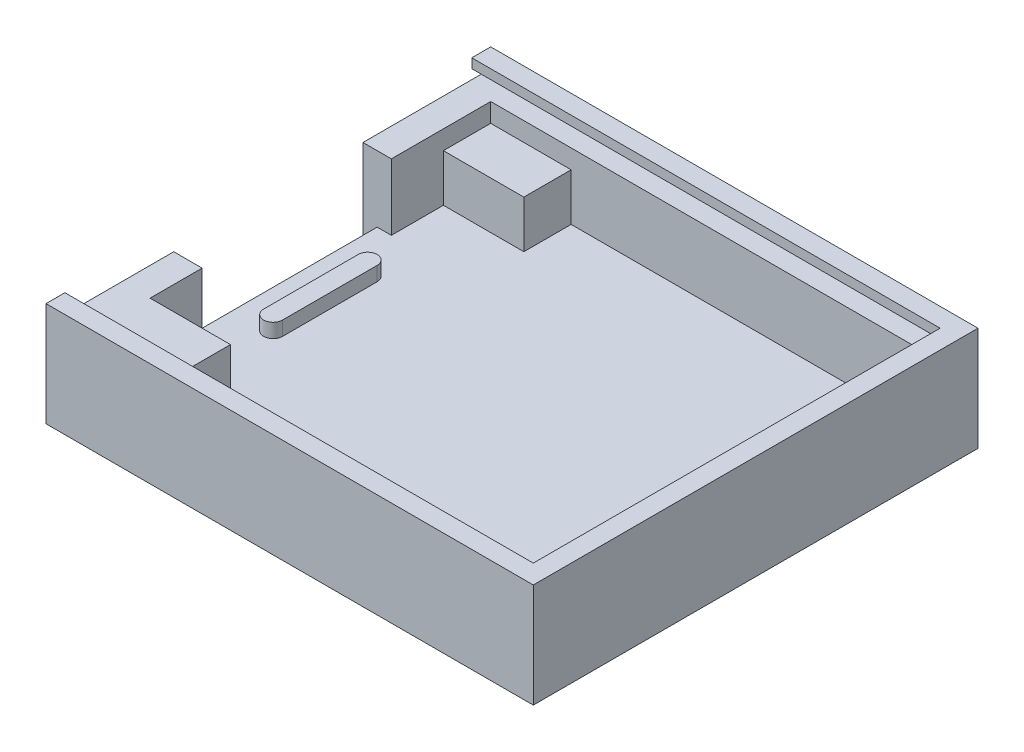
ISO-10303-21;
HEADER;
FILE_DESCRIPTION(('STEP AP214'),'2;1');
FILE_NAME('part.step','',(''),(''),'','','');
FILE_SCHEMA(('AUTOMOTIVE_DESIGN { 1 0 10303 214 1 1 1 1 }'));
ENDSEC;
DATA;
#1=APPLICATION_CONTEXT('core data for automotive mechanical design processes');
#2=APPLICATION_PROTOCOL_DEFINITION('international standard','automotive_design',2000,#1);
#3=PRODUCT_CONTEXT('',#1,'mechanical');
#4=PRODUCT('Part','Part','',(#3));
#5=PRODUCT_RELATED_PRODUCT_CATEGORY('part','',(#4));
#6=PRODUCT_DEFINITION_FORMATION('','',#4);
#7=PRODUCT_DEFINITION_CONTEXT('part definition',#1,'design');
#8=PRODUCT_DEFINITION('design','',#6,#7);
#9=PRODUCT_DEFINITION_SHAPE('','',#8);
#10=(LENGTH_UNIT() NAMED_UNIT(*) SI_UNIT(.MILLI.,.METRE.));
#11=(NAMED_UNIT(*) PLANE_ANGLE_UNIT() SI_UNIT($,.RADIAN.));
#12=(NAMED_UNIT(*) SI_UNIT($,.STERADIAN.) SOLID_ANGLE_UNIT());
#13=UNCERTAINTY_MEASURE_WITH_UNIT(LENGTH_MEASURE(1.E-05),#10,'distance_accuracy_value','');
#14=(GEOMETRIC_REPRESENTATION_CONTEXT(3) GLOBAL_UNCERTAINTY_ASSIGNED_CONTEXT((#13)) GLOBAL_UNIT_ASSIGNED_CONTEXT((#10,
#11,#12)) REPRESENTATION_CONTEXT('',''));
#15=CARTESIAN_POINT('',(0.,0.,0.));
#16=DIRECTION('',(0.,0.,1.));
#17=DIRECTION('',(1.,0.,0.));
#18=AXIS2_PLACEMENT_3D('',#15,#16,#17);
#19=CARTESIAN_POINT('',(-51.5,2.,-47.));
#20=DIRECTION('',(1.,0.,0.));
#21=DIRECTION('',(0.,0.,-1.));
#22=AXIS2_PLACEMENT_3D('',#19,#20,#21);
#23=PLANE('',#22);
#24=DIRECTION('',(0.,0.,1.));
#25=VECTOR('',#24,1.);
#26=CARTESIAN_POINT('',(-51.5,0.,-47.));
#27=LINE('',#26,#25);
#28=CARTESIAN_POINT('',(-51.5,0.,-47.));
#29=VERTEX_POINT('',#28);
#30=CARTESIAN_POINT('',(-51.5,0.,-33.5));
#31=VERTEX_POINT('',#30);
#32=EDGE_CURVE('E264',#29,#31,#27,.T.);
#33=ORIENTED_EDGE('',*,*,#32,.T.);
#34=DIRECTION('',(0.,1.,0.));
#35=VECTOR('',#34,1.);
#36=CARTESIAN_POINT('',(-51.5,2.,-33.5));
#37=LINE('',#36,#35);
#38=CARTESIAN_POINT('',(-51.5,9.,-33.5));
#39=VERTEX_POINT('',#38);
#40=EDGE_CURVE('E430',#31,#39,#37,.T.);
#41=ORIENTED_EDGE('',*,*,#40,.T.);
#42=DIRECTION('',(0.,0.,1.));
#43=VECTOR('',#42,1.);
#44=CARTESIAN_POINT('',(-51.5,9.,-47.));
#45=LINE('',#44,#43);
#46=CARTESIAN_POINT('',(-51.5,9.,-46.));
#47=VERTEX_POINT('',#46);
#48=EDGE_CURVE('E280',#47,#39,#45,.T.);
#49=ORIENTED_EDGE('',*,*,#48,.F.);
#50=DIRECTION('',(0.,-1.,0.));
#51=VECTOR('',#50,1.);
#52=CARTESIAN_POINT('',(-51.5,11.,-46.));
#53=LINE('',#52,#51);
#54=CARTESIAN_POINT('',(-51.5,10.,-46.));
#55=VERTEX_POINT('',#54);
#56=EDGE_CURVE('E360',#55,#47,#53,.T.);
#57=ORIENTED_EDGE('',*,*,#56,.F.);
#58=DIRECTION('',(0.,0.,-1.));
#59=VECTOR('',#58,1.);
#60=CARTESIAN_POINT('',(-51.5,10.,-45.));
#61=LINE('',#60,#59);
#62=CARTESIAN_POINT('',(-51.5,10.,-45.));
#63=VERTEX_POINT('',#62);
#64=EDGE_CURVE('E483',#63,#55,#61,.T.);
#65=ORIENTED_EDGE('',*,*,#64,.F.);
#66=DIRECTION('',(0.,-1.,0.));
#67=VECTOR('',#66,1.);
#68=CARTESIAN_POINT('',(-51.5,11.,-45.));
#69=LINE('',#68,#67);
#70=CARTESIAN_POINT('',(-51.5,11.,-45.));
#71=VERTEX_POINT('',#70);
#72=EDGE_CURVE('E524',#71,#63,#69,.T.);
#73=ORIENTED_EDGE('',*,*,#72,.F.);
#74=DIRECTION('',(0.,0.,1.));
#75=VECTOR('',#74,1.);
#76=CARTESIAN_POINT('',(-51.5,11.,-46.));
#77=LINE('',#76,#75);
#78=CARTESIAN_POINT('',(-51.5,11.,-47.));
#79=VERTEX_POINT('',#78);
#80=EDGE_CURVE('E336',#79,#71,#77,.T.);
#81=ORIENTED_EDGE('',*,*,#80,.F.);
#82=DIRECTION('',(0.,-1.,0.));
#83=VECTOR('',#82,1.);
#84=CARTESIAN_POINT('',(-51.5,2.,-47.));
#85=LINE('',#84,#83);
#86=EDGE_CURVE('E43',#79,#29,#85,.T.);
#87=ORIENTED_EDGE('',*,*,#86,.T.);
#88=EDGE_LOOP('',(#33,#41,#49,#57,#65,#73,#81,#87));
#89=FACE_BOUND('',#88,.T.);
#90=ADVANCED_FACE('F33',(#89),#23,.F.);
#91=CARTESIAN_POINT('',(-0.999999999999994,11.,-0.999999999999994));
#92=DIRECTION('',(1.,0.,0.));
#93=DIRECTION('',(0.,0.,-1.));
#94=AXIS2_PLACEMENT_3D('',#91,#92,#93);
#95=PLANE('',#94);
#96=DIRECTION('',(0.,-1.,0.));
#97=VECTOR('',#96,1.);
#98=CARTESIAN_POINT('',(-0.999999999999994,11.,-0.999999999999994));
#99=LINE('',#98,#97);
#100=CARTESIAN_POINT('',(-0.999999999999994,10.,-0.999999999999994));
#101=VERTEX_POINT('',#100);
#102=CARTESIAN_POINT('',(-0.999999999999994,9.,-0.999999999999994));
#103=VERTEX_POINT('',#102);
#104=EDGE_CURVE('E351',#101,#103,#99,.T.);
#105=ORIENTED_EDGE('',*,*,#104,.F.);
#106=DIRECTION('',(0.,0.,-1.));
#107=VECTOR('',#106,1.);
#108=CARTESIAN_POINT('',(-0.999999999999994,10.,-45.));
#109=LINE('',#108,#107);
#110=CARTESIAN_POINT('',(-0.999999999999994,10.,-46.));
#111=VERTEX_POINT('',#110);
#112=EDGE_CURVE('E480',#101,#111,#109,.T.);
#113=ORIENTED_EDGE('',*,*,#112,.T.);
#114=DIRECTION('',(0.,-1.,0.));
#115=VECTOR('',#114,1.);
#116=CARTESIAN_POINT('',(-0.999999999999994,11.,-46.));
#117=LINE('',#116,#115);
#118=CARTESIAN_POINT('',(-0.999999999999994,9.,-46.));
#119=VERTEX_POINT('',#118);
#120=EDGE_CURVE('E362',#111,#119,#117,.T.);
#121=ORIENTED_EDGE('',*,*,#120,.T.);
#122=DIRECTION('',(0.,0.,1.));
#123=VECTOR('',#122,1.);
#124=CARTESIAN_POINT('',(-0.999999999999994,9.,-0.999999999999994));
#125=LINE('',#124,#123);
#126=EDGE_CURVE('E344',#119,#103,#125,.T.);
#127=ORIENTED_EDGE('',*,*,#126,.T.);
#128=EDGE_LOOP('',(#105,#113,#121,#127));
#129=FACE_BOUND('',#128,.T.);
#130=ADVANCED_FACE('F479',(#129),#95,.F.);
#131=CARTESIAN_POINT('',(0.,0.,-45.));
#132=DIRECTION('',(0.,0.,1.));
#133=DIRECTION('',(1.,0.,0.));
#134=AXIS2_PLACEMENT_3D('',#131,#132,#133);
#135=PLANE('',#134);
#136=DIRECTION('',(1.,0.,0.));
#137=VECTOR('',#136,1.);
#138=CARTESIAN_POINT('',(-51.5,10.,-45.));
#139=LINE('',#138,#137);
#140=CARTESIAN_POINT('',(-1.99999999999999,10.,-45.));
#141=VERTEX_POINT('',#140);
#142=EDGE_CURVE('E56',#63,#141,#139,.T.);
#143=ORIENTED_EDGE('',*,*,#142,.T.);
#144=DIRECTION('',(0.,-1.,0.));
#145=VECTOR('',#144,1.);
#146=CARTESIAN_POINT('',(-1.99999999999999,11.,-45.));
#147=LINE('',#146,#145);
#148=CARTESIAN_POINT('',(-1.99999999999999,11.,-45.));
#149=VERTEX_POINT('',#148);
#150=EDGE_CURVE('E51',#149,#141,#147,.T.);
#151=ORIENTED_EDGE('',*,*,#150,.F.);
#152=DIRECTION('',(-1.,0.,0.));
#153=VECTOR('',#152,1.);
#154=CARTESIAN_POINT('',(-51.5,11.,-45.));
#155=LINE('',#154,#153);
#156=EDGE_CURVE('E488',#149,#71,#155,.T.);
#157=ORIENTED_EDGE('',*,*,#156,.T.);
#158=ORIENTED_EDGE('',*,*,#72,.T.);
#159=EDGE_LOOP('',(#143,#151,#157,#158));
#160=FACE_BOUND('',#159,.T.);
#161=ADVANCED_FACE('F582',(#160),#135,.T.);
#162=CARTESIAN_POINT('',(0.,0.,-1.99999999999999));
#163=DIRECTION('',(0.,0.,1.));
#164=DIRECTION('',(1.,0.,0.));
#165=AXIS2_PLACEMENT_3D('',#162,#163,#164);
#166=PLANE('',#165);
#167=DIRECTION('',(0.,1.,0.));
#168=VECTOR('',#167,1.);
#169=CARTESIAN_POINT('',(-1.99999999999999,11.,-1.99999999999999));
#170=LINE('',#169,#168);
#171=CARTESIAN_POINT('',(-1.99999999999999,10.,-1.99999999999999));
#172=VERTEX_POINT('',#171);
#173=CARTESIAN_POINT('',(-1.99999999999999,11.,-1.99999999999999));
#174=VERTEX_POINT('',#173);
#175=EDGE_CURVE('E575',#172,#174,#170,.T.);
#176=ORIENTED_EDGE('',*,*,#175,.F.);
#177=DIRECTION('',(-1.,0.,0.));
#178=VECTOR('',#177,1.);
#179=CARTESIAN_POINT('',(-51.5,10.,-1.99999999999999));
#180=LINE('',#179,#178);
#181=CARTESIAN_POINT('',(-51.5,10.,-1.99999999999999));
#182=VERTEX_POINT('',#181);
#183=EDGE_CURVE('E509',#172,#182,#180,.T.);
#184=ORIENTED_EDGE('',*,*,#183,.T.);
#185=DIRECTION('',(0.,1.,0.));
#186=VECTOR('',#185,1.);
#187=CARTESIAN_POINT('',(-51.5,11.,-1.99999999999999));
#188=LINE('',#187,#186);
#189=CARTESIAN_POINT('',(-51.5,11.,-1.99999999999999));
#190=VERTEX_POINT('',#189);
#191=EDGE_CURVE('E502',#182,#190,#188,.T.);
#192=ORIENTED_EDGE('',*,*,#191,.T.);
#193=DIRECTION('',(1.,0.,0.));
#194=VECTOR('',#193,1.);
#195=CARTESIAN_POINT('',(-51.5,11.,-1.99999999999999));
#196=LINE('',#195,#194);
#197=EDGE_CURVE('E504',#190,#174,#196,.T.);
#198=ORIENTED_EDGE('',*,*,#197,.T.);
#199=EDGE_LOOP('',(#176,#184,#192,#198));
#200=FACE_BOUND('',#199,.T.);
#201=ADVANCED_FACE('F511',(#200),#166,.F.);
#202=CARTESIAN_POINT('',(-51.5,11.,-0.999999999999994));
#203=DIRECTION('',(0.,0.,1.));
#204=DIRECTION('',(1.,0.,0.));
#205=AXIS2_PLACEMENT_3D('',#202,#203,#204);
#206=PLANE('',#205);
#207=DIRECTION('',(-1.,0.,0.));
#208=VECTOR('',#207,1.);
#209=CARTESIAN_POINT('',(-51.5,10.,-0.999999999999994));
#210=LINE('',#209,#208);
#211=CARTESIAN_POINT('',(-51.5,10.,-0.999999999999994));
#212=VERTEX_POINT('',#211);
#213=EDGE_CURVE('E478',#101,#212,#210,.T.);
#214=ORIENTED_EDGE('',*,*,#213,.F.);
#215=ORIENTED_EDGE('',*,*,#104,.T.);
#216=DIRECTION('',(-1.,0.,0.));
#217=VECTOR('',#216,1.);
#218=CARTESIAN_POINT('',(-51.5,9.,-0.999999999999994));
#219=LINE('',#218,#217);
#220=CARTESIAN_POINT('',(-51.5,9.,-0.999999999999994));
#221=VERTEX_POINT('',#220);
#222=EDGE_CURVE('E347',#103,#221,#219,.T.);
#223=ORIENTED_EDGE('',*,*,#222,.T.);
#224=DIRECTION('',(0.,-1.,0.));
#225=VECTOR('',#224,1.);
#226=CARTESIAN_POINT('',(-51.5,11.,-0.999999999999994));
#227=LINE('',#226,#225);
#228=EDGE_CURVE('E37',#212,#221,#227,.T.);
#229=ORIENTED_EDGE('',*,*,#228,.F.);
#230=EDGE_LOOP('',(#214,#215,#223,#229));
#231=FACE_BOUND('',#230,.T.);
#232=ADVANCED_FACE('F476',(#231),#206,.F.);
#233=CARTESIAN_POINT('',(-0.999999999999994,11.,-46.));
#234=DIRECTION('',(0.,0.,-1.));
#235=DIRECTION('',(-1.,0.,0.));
#236=AXIS2_PLACEMENT_3D('',#233,#234,#235);
#237=PLANE('',#236);
#238=DIRECTION('',(1.,0.,0.));
#239=VECTOR('',#238,1.);
#240=CARTESIAN_POINT('',(-51.5,10.,-46.));
#241=LINE('',#240,#239);
#242=EDGE_CURVE('E523',#55,#111,#241,.T.);
#243=ORIENTED_EDGE('',*,*,#242,.F.);
#244=ORIENTED_EDGE('',*,*,#56,.T.);
#245=DIRECTION('',(1.,0.,0.));
#246=VECTOR('',#245,1.);
#247=CARTESIAN_POINT('',(-0.999999999999994,9.,-46.));
#248=LINE('',#247,#246);
#249=EDGE_CURVE('E348',#47,#119,#248,.T.);
#250=ORIENTED_EDGE('',*,*,#249,.T.);
#251=ORIENTED_EDGE('',*,*,#120,.F.);
#252=EDGE_LOOP('',(#243,#244,#250,#251));
#253=FACE_BOUND('',#252,.T.);
#254=ADVANCED_FACE('F482',(#253),#237,.F.);
#255=CARTESIAN_POINT('',(0.,2.,0.));
#256=DIRECTION('',(0.,1.,0.));
#257=DIRECTION('',(0.,0.,1.));
#258=AXIS2_PLACEMENT_3D('',#255,#256,#257);
#259=PLANE('',#258);
#260=DIRECTION('',(0.,0.,-1.));
#261=VECTOR('',#260,1.);
#262=CARTESIAN_POINT('',(-50.,2.,-13.5));
#263=LINE('',#262,#261);
#264=CARTESIAN_POINT('',(-50.,2.,-13.5));
#265=VERTEX_POINT('',#264);
#266=CARTESIAN_POINT('',(-50.,2.,-33.5));
#267=VERTEX_POINT('',#266);
#268=EDGE_CURVE('E258',#265,#267,#263,.T.);
#269=ORIENTED_EDGE('',*,*,#268,.F.);
#270=DIRECTION('',(1.,0.,0.));
#271=VECTOR('',#270,1.);
#272=CARTESIAN_POINT('',(0.,2.,-13.5));
#273=LINE('',#272,#271);
#274=CARTESIAN_POINT('',(-48.5,2.,-13.5));
#275=VERTEX_POINT('',#274);
#276=EDGE_CURVE('E423',#265,#275,#273,.T.);
#277=ORIENTED_EDGE('',*,*,#276,.T.);
#278=DIRECTION('',(0.,0.,1.));
#279=VECTOR('',#278,1.);
#280=CARTESIAN_POINT('',(-48.5,2.,-44.));
#281=LINE('',#280,#279);
#282=CARTESIAN_POINT('',(-48.5,2.,-8.));
#283=VERTEX_POINT('',#282);
#284=EDGE_CURVE('E452',#275,#283,#281,.T.);
#285=ORIENTED_EDGE('',*,*,#284,.T.);
#286=DIRECTION('',(-1.,0.,0.));
#287=VECTOR('',#286,1.);
#288=CARTESIAN_POINT('',(-48.5,2.,-8.));
#289=LINE('',#288,#287);
#290=CARTESIAN_POINT('',(-40.,2.,-8.));
#291=VERTEX_POINT('',#290);
#292=EDGE_CURVE('E407',#291,#283,#289,.T.);
#293=ORIENTED_EDGE('',*,*,#292,.F.);
#294=DIRECTION('',(0.,0.,-1.));
#295=VECTOR('',#294,1.);
#296=CARTESIAN_POINT('',(-40.,2.,-3.));
#297=LINE('',#296,#295);
#298=CARTESIAN_POINT('',(-40.,2.,-3.));
#299=VERTEX_POINT('',#298);
#300=EDGE_CURVE('E401',#299,#291,#297,.T.);
#301=ORIENTED_EDGE('',*,*,#300,.F.);
#302=DIRECTION('',(1.,0.,0.));
#303=VECTOR('',#302,1.);
#304=CARTESIAN_POINT('',(-48.5,2.,-3.));
#305=LINE('',#304,#303);
#306=CARTESIAN_POINT('',(-3.,2.,-3.));
#307=VERTEX_POINT('',#306);
#308=EDGE_CURVE('E456',#299,#307,#305,.T.);
#309=ORIENTED_EDGE('',*,*,#308,.T.);
#310=DIRECTION('',(0.,0.,-1.));
#311=VECTOR('',#310,1.);
#312=CARTESIAN_POINT('',(-3.,2.,-3.));
#313=LINE('',#312,#311);
#314=CARTESIAN_POINT('',(-3.,2.,-44.));
#315=VERTEX_POINT('',#314);
#316=EDGE_CURVE('E441',#307,#315,#313,.T.);
#317=ORIENTED_EDGE('',*,*,#316,.T.);
#318=DIRECTION('',(-1.,0.,0.));
#319=VECTOR('',#318,1.);
#320=CARTESIAN_POINT('',(-3.,2.,-44.));
#321=LINE('',#320,#319);
#322=CARTESIAN_POINT('',(-40.,2.,-44.));
#323=VERTEX_POINT('',#322);
#324=EDGE_CURVE('E433',#315,#323,#321,.T.);
#325=ORIENTED_EDGE('',*,*,#324,.T.);
#326=DIRECTION('',(0.,0.,-1.));
#327=VECTOR('',#326,1.);
#328=CARTESIAN_POINT('',(-40.,2.,-44.));
#329=LINE('',#328,#327);
#330=CARTESIAN_POINT('',(-40.,2.,-39.));
#331=VERTEX_POINT('',#330);
#332=EDGE_CURVE('E369',#331,#323,#329,.T.);
#333=ORIENTED_EDGE('',*,*,#332,.F.);
#334=DIRECTION('',(1.,0.,0.));
#335=VECTOR('',#334,1.);
#336=CARTESIAN_POINT('',(-48.5,2.,-39.));
#337=LINE('',#336,#335);
#338=CARTESIAN_POINT('',(-48.5,2.,-39.));
#339=VERTEX_POINT('',#338);
#340=EDGE_CURVE('E361',#339,#331,#337,.T.);
#341=ORIENTED_EDGE('',*,*,#340,.F.);
#342=CARTESIAN_POINT('',(-48.5,2.,-33.5));
#343=VERTEX_POINT('',#342);
#344=EDGE_CURVE('E453',#339,#343,#281,.T.);
#345=ORIENTED_EDGE('',*,*,#344,.T.);
#346=DIRECTION('',(1.,0.,0.));
#347=VECTOR('',#346,1.);
#348=CARTESIAN_POINT('',(0.,2.,-33.5));
#349=LINE('',#348,#347);
#350=EDGE_CURVE('E247',#267,#343,#349,.T.);
#351=ORIENTED_EDGE('',*,*,#350,.F.);
#352=EDGE_LOOP('',(#269,#277,#285,#293,#301,#309,#317,#325,#333,#341,#345,#351));
#353=FACE_BOUND('',#352,.T.);
#354=DIRECTION('',(0.,0.,1.));
#355=VECTOR('',#354,1.);
#356=CARTESIAN_POINT('',(-47.,2.,-28.5));
#357=LINE('',#356,#355);
#358=CARTESIAN_POINT('',(-47.,2.,-28.5));
#359=VERTEX_POINT('',#358);
#360=CARTESIAN_POINT('',(-47.,2.,-18.5));
#361=VERTEX_POINT('',#360);
#362=EDGE_CURVE('E305',#359,#361,#357,.T.);
#363=ORIENTED_EDGE('',*,*,#362,.F.);
#364=CARTESIAN_POINT('',(-46.,2.,-28.5));
#365=DIRECTION('',(0.,1.,0.));
#366=DIRECTION('',(0.,0.,1.));
#367=AXIS2_PLACEMENT_3D('',#364,#365,#366);
#368=CIRCLE('',#367,1.);
#369=CARTESIAN_POINT('',(-45.,2.,-28.5));
#370=VERTEX_POINT('',#369);
#371=EDGE_CURVE('E283',#370,#359,#368,.T.);
#372=ORIENTED_EDGE('',*,*,#371,.F.);
#373=DIRECTION('',(0.,0.,1.));
#374=VECTOR('',#373,1.);
#375=CARTESIAN_POINT('',(-45.,2.,-28.5));
#376=LINE('',#375,#374);
#377=CARTESIAN_POINT('',(-45.,2.,-18.5));
#378=VERTEX_POINT('',#377);
#379=EDGE_CURVE('E295',#370,#378,#376,.T.);
#380=ORIENTED_EDGE('',*,*,#379,.T.);
#381=CARTESIAN_POINT('',(-46.,2.,-18.5));
#382=DIRECTION('',(0.,1.,0.));
#383=DIRECTION('',(0.,0.,1.));
#384=AXIS2_PLACEMENT_3D('',#381,#382,#383);
#385=CIRCLE('',#384,0.999999999999997);
#386=EDGE_CURVE('E308',#361,#378,#385,.T.);
#387=ORIENTED_EDGE('',*,*,#386,.F.);
#388=EDGE_LOOP('',(#363,#372,#380,#387));
#389=FACE_BOUND('',#388,.T.);
#390=ADVANCED_FACE('F549',(#353,#389),#259,.T.);
#391=CARTESIAN_POINT('',(-48.5,9.,-44.));
#392=DIRECTION('',(1.,0.,0.));
#393=DIRECTION('',(0.,0.,-1.));
#394=AXIS2_PLACEMENT_3D('',#391,#392,#393);
#395=PLANE('',#394);
#396=ORIENTED_EDGE('',*,*,#344,.F.);
#397=DIRECTION('',(0.,-1.,0.));
#398=VECTOR('',#397,1.);
#399=CARTESIAN_POINT('',(-48.5,7.,-39.));
#400=LINE('',#399,#398);
#401=CARTESIAN_POINT('',(-48.5,7.,-39.));
#402=VERTEX_POINT('',#401);
#403=EDGE_CURVE('E394',#402,#339,#400,.T.);
#404=ORIENTED_EDGE('',*,*,#403,.F.);
#405=DIRECTION('',(0.,0.,1.));
#406=VECTOR('',#405,1.);
#407=CARTESIAN_POINT('',(-48.5,7.,-44.));
#408=LINE('',#407,#406);
#409=CARTESIAN_POINT('',(-48.5,7.,-44.));
#410=VERTEX_POINT('',#409);
#411=EDGE_CURVE('E376',#410,#402,#408,.T.);
#412=ORIENTED_EDGE('',*,*,#411,.F.);
#413=DIRECTION('',(0.,-1.,0.));
#414=VECTOR('',#413,1.);
#415=CARTESIAN_POINT('',(-48.5,9.,-44.));
#416=LINE('',#415,#414);
#417=CARTESIAN_POINT('',(-48.5,9.,-44.));
#418=VERTEX_POINT('',#417);
#419=EDGE_CURVE('E288',#418,#410,#416,.T.);
#420=ORIENTED_EDGE('',*,*,#419,.F.);
#421=DIRECTION('',(0.,0.,1.));
#422=VECTOR('',#421,1.);
#423=CARTESIAN_POINT('',(-48.5,9.,-44.));
#424=LINE('',#423,#422);
#425=CARTESIAN_POINT('',(-48.5,9.,-33.5));
#426=VERTEX_POINT('',#425);
#427=EDGE_CURVE('E442',#418,#426,#424,.T.);
#428=ORIENTED_EDGE('',*,*,#427,.T.);
#429=DIRECTION('',(0.,1.,0.));
#430=VECTOR('',#429,1.);
#431=CARTESIAN_POINT('',(-48.5,2.,-33.5));
#432=LINE('',#431,#430);
#433=EDGE_CURVE('E434',#343,#426,#432,.T.);
#434=ORIENTED_EDGE('',*,*,#433,.F.);
#435=EDGE_LOOP('',(#396,#404,#412,#420,#428,#434));
#436=FACE_BOUND('',#435,.T.);
#437=ADVANCED_FACE('F539',(#436),#395,.T.);
#438=CARTESIAN_POINT('',(-3.,9.,-44.));
#439=DIRECTION('',(0.,0.,1.));
#440=DIRECTION('',(1.,0.,0.));
#441=AXIS2_PLACEMENT_3D('',#438,#439,#440);
#442=PLANE('',#441);
#443=DIRECTION('',(-1.,0.,0.));
#444=VECTOR('',#443,1.);
#445=CARTESIAN_POINT('',(-48.5,7.,-44.));
#446=LINE('',#445,#444);
#447=CARTESIAN_POINT('',(-40.,7.,-44.));
#448=VERTEX_POINT('',#447);
#449=EDGE_CURVE('E384',#448,#410,#446,.T.);
#450=ORIENTED_EDGE('',*,*,#449,.F.);
#451=DIRECTION('',(0.,-1.,0.));
#452=VECTOR('',#451,1.);
#453=CARTESIAN_POINT('',(-40.,7.,-44.));
#454=LINE('',#453,#452);
#455=EDGE_CURVE('E386',#448,#323,#454,.T.);
#456=ORIENTED_EDGE('',*,*,#455,.T.);
#457=ORIENTED_EDGE('',*,*,#324,.F.);
#458=DIRECTION('',(0.,-1.,0.));
#459=VECTOR('',#458,1.);
#460=CARTESIAN_POINT('',(-3.,9.,-44.));
#461=LINE('',#460,#459);
#462=CARTESIAN_POINT('',(-3.,9.,-44.));
#463=VERTEX_POINT('',#462);
#464=EDGE_CURVE('E449',#463,#315,#461,.T.);
#465=ORIENTED_EDGE('',*,*,#464,.F.);
#466=DIRECTION('',(-1.,0.,0.));
#467=VECTOR('',#466,1.);
#468=CARTESIAN_POINT('',(-3.,9.,-44.));
#469=LINE('',#468,#467);
#470=EDGE_CURVE('E438',#463,#418,#469,.T.);
#471=ORIENTED_EDGE('',*,*,#470,.T.);
#472=ORIENTED_EDGE('',*,*,#419,.T.);
#473=EDGE_LOOP('',(#450,#456,#457,#465,#471,#472));
#474=FACE_BOUND('',#473,.T.);
#475=ADVANCED_FACE('F543',(#474),#442,.T.);
#476=CARTESIAN_POINT('',(-48.5,9.,-13.5));
#477=VERTEX_POINT('',#476);
#478=CARTESIAN_POINT('',(-48.5,9.,-8.));
#479=VERTEX_POINT('',#478);
#480=EDGE_CURVE('E440',#477,#479,#424,.T.);
#481=ORIENTED_EDGE('',*,*,#480,.T.);
#482=DIRECTION('',(0.,-1.,0.));
#483=VECTOR('',#482,1.);
#484=CARTESIAN_POINT('',(-48.5,9.,-8.));
#485=LINE('',#484,#483);
#486=EDGE_CURVE('E410',#479,#283,#485,.T.);
#487=ORIENTED_EDGE('',*,*,#486,.T.);
#488=ORIENTED_EDGE('',*,*,#284,.F.);
#489=DIRECTION('',(0.,1.,0.));
#490=VECTOR('',#489,1.);
#491=CARTESIAN_POINT('',(-48.5,2.,-13.5));
#492=LINE('',#491,#490);
#493=EDGE_CURVE('E246',#275,#477,#492,.T.);
#494=ORIENTED_EDGE('',*,*,#493,.T.);
#495=EDGE_LOOP('',(#481,#487,#488,#494));
#496=FACE_BOUND('',#495,.T.);
#497=ADVANCED_FACE('F564',(#496),#395,.T.);
#498=CARTESIAN_POINT('',(-48.5,9.,-3.));
#499=DIRECTION('',(0.,0.,-1.));
#500=DIRECTION('',(-1.,0.,0.));
#501=AXIS2_PLACEMENT_3D('',#498,#499,#500);
#502=PLANE('',#501);
#503=ORIENTED_EDGE('',*,*,#308,.F.);
#504=DIRECTION('',(0.,-1.,0.));
#505=VECTOR('',#504,1.);
#506=CARTESIAN_POINT('',(-40.,9.,-3.));
#507=LINE('',#506,#505);
#508=CARTESIAN_POINT('',(-40.,9.,-3.));
#509=VERTEX_POINT('',#508);
#510=EDGE_CURVE('E419',#509,#299,#507,.T.);
#511=ORIENTED_EDGE('',*,*,#510,.F.);
#512=DIRECTION('',(1.,0.,0.));
#513=VECTOR('',#512,1.);
#514=CARTESIAN_POINT('',(-48.5,9.,-3.));
#515=LINE('',#514,#513);
#516=CARTESIAN_POINT('',(-3.,9.,-3.));
#517=VERTEX_POINT('',#516);
#518=EDGE_CURVE('E445',#509,#517,#515,.T.);
#519=ORIENTED_EDGE('',*,*,#518,.T.);
#520=DIRECTION('',(0.,-1.,0.));
#521=VECTOR('',#520,1.);
#522=CARTESIAN_POINT('',(-3.,9.,-3.));
#523=LINE('',#522,#521);
#524=EDGE_CURVE('E460',#517,#307,#523,.T.);
#525=ORIENTED_EDGE('',*,*,#524,.T.);
#526=EDGE_LOOP('',(#503,#511,#519,#525));
#527=FACE_BOUND('',#526,.T.);
#528=ADVANCED_FACE('F552',(#527),#502,.T.);
#529=CARTESIAN_POINT('',(0.,9.,0.));
#530=DIRECTION('',(0.,1.,0.));
#531=DIRECTION('',(0.,0.,1.));
#532=AXIS2_PLACEMENT_3D('',#529,#530,#531);
#533=PLANE('',#532);
#534=ORIENTED_EDGE('',*,*,#222,.F.);
#535=ORIENTED_EDGE('',*,*,#126,.F.);
#536=ORIENTED_EDGE('',*,*,#249,.F.);
#537=ORIENTED_EDGE('',*,*,#48,.T.);
#538=DIRECTION('',(1.,0.,0.));
#539=VECTOR('',#538,1.);
#540=CARTESIAN_POINT('',(0.,9.,-33.5));
#541=LINE('',#540,#539);
#542=EDGE_CURVE('E425',#39,#426,#541,.T.);
#543=ORIENTED_EDGE('',*,*,#542,.T.);
#544=ORIENTED_EDGE('',*,*,#427,.F.);
#545=ORIENTED_EDGE('',*,*,#470,.F.);
#546=DIRECTION('',(0.,0.,-1.));
#547=VECTOR('',#546,1.);
#548=CARTESIAN_POINT('',(-3.,9.,-3.));
#549=LINE('',#548,#547);
#550=EDGE_CURVE('E447',#517,#463,#549,.T.);
#551=ORIENTED_EDGE('',*,*,#550,.F.);
#552=ORIENTED_EDGE('',*,*,#518,.F.);
#553=DIRECTION('',(0.,0.,-1.));
#554=VECTOR('',#553,1.);
#555=CARTESIAN_POINT('',(-40.,9.,-3.));
#556=LINE('',#555,#554);
#557=CARTESIAN_POINT('',(-40.,9.,-8.));
#558=VERTEX_POINT('',#557);
#559=EDGE_CURVE('E404',#509,#558,#556,.T.);
#560=ORIENTED_EDGE('',*,*,#559,.T.);
#561=DIRECTION('',(-1.,0.,0.));
#562=VECTOR('',#561,1.);
#563=CARTESIAN_POINT('',(-48.5,9.,-8.));
#564=LINE('',#563,#562);
#565=EDGE_CURVE('E406',#558,#479,#564,.T.);
#566=ORIENTED_EDGE('',*,*,#565,.T.);
#567=ORIENTED_EDGE('',*,*,#480,.F.);
#568=DIRECTION('',(1.,0.,0.));
#569=VECTOR('',#568,1.);
#570=CARTESIAN_POINT('',(0.,9.,-13.5));
#571=LINE('',#570,#569);
#572=CARTESIAN_POINT('',(-51.5,9.,-13.5));
#573=VERTEX_POINT('',#572);
#574=EDGE_CURVE('E422',#573,#477,#571,.T.);
#575=ORIENTED_EDGE('',*,*,#574,.F.);
#576=EDGE_CURVE('E243',#573,#221,#45,.T.);
#577=ORIENTED_EDGE('',*,*,#576,.T.);
#578=EDGE_LOOP('',(#534,#535,#536,#537,#543,#544,#545,#551,#552,#560,#566,#567,#575,#577));
#579=FACE_BOUND('',#578,.T.);
#580=ADVANCED_FACE('F471',(#579),#533,.T.);
#581=CARTESIAN_POINT('',(-51.5,5.5,-5.5));
#582=DIRECTION('',(1.,0.,0.));
#583=DIRECTION('',(0.,0.,-1.));
#584=AXIS2_PLACEMENT_3D('',#581,#582,#583);
#585=CIRCLE('',#584,0.500000000000001);
#586=CARTESIAN_POINT('',(-51.5,5.5,-6.));
#587=VERTEX_POINT('',#586);
#588=EDGE_CURVE('E398',#587,#587,#585,.T.);
#589=ORIENTED_EDGE('',*,*,#588,.T.);
#590=EDGE_LOOP('',(#589));
#591=FACE_BOUND('',#590,.T.);
#592=DIRECTION('',(0.,1.,0.));
#593=VECTOR('',#592,1.);
#594=CARTESIAN_POINT('',(-51.5,2.,-13.5));
#595=LINE('',#594,#593);
#596=CARTESIAN_POINT('',(-51.5,0.,-13.5));
#597=VERTEX_POINT('',#596);
#598=EDGE_CURVE('E236',#597,#573,#595,.T.);
#599=ORIENTED_EDGE('',*,*,#598,.F.);
#600=CARTESIAN_POINT('',(-51.5,0.,0.));
#601=VERTEX_POINT('',#600);
#602=EDGE_CURVE('E240',#597,#601,#27,.T.);
#603=ORIENTED_EDGE('',*,*,#602,.T.);
#604=DIRECTION('',(0.,-1.,0.));
#605=VECTOR('',#604,1.);
#606=CARTESIAN_POINT('',(-51.5,2.,0.));
#607=LINE('',#606,#605);
#608=CARTESIAN_POINT('',(-51.5,11.,0.));
#609=VERTEX_POINT('',#608);
#610=EDGE_CURVE('E276',#609,#601,#607,.T.);
#611=ORIENTED_EDGE('',*,*,#610,.F.);
#612=DIRECTION('',(0.,0.,1.));
#613=VECTOR('',#612,1.);
#614=CARTESIAN_POINT('',(-51.5,11.,0.));
#615=LINE('',#614,#613);
#616=EDGE_CURVE('E356',#190,#609,#615,.T.);
#617=ORIENTED_EDGE('',*,*,#616,.F.);
#618=ORIENTED_EDGE('',*,*,#191,.F.);
#619=DIRECTION('',(0.,0.,1.));
#620=VECTOR('',#619,1.);
#621=CARTESIAN_POINT('',(-51.5,10.,-1.99999999999999));
#622=LINE('',#621,#620);
#623=EDGE_CURVE('E520',#182,#212,#622,.T.);
#624=ORIENTED_EDGE('',*,*,#623,.T.);
#625=ORIENTED_EDGE('',*,*,#228,.T.);
#626=ORIENTED_EDGE('',*,*,#576,.F.);
#627=EDGE_LOOP('',(#599,#603,#611,#617,#618,#624,#625,#626));
#628=FACE_BOUND('',#627,.T.);
#629=ADVANCED_FACE('F238',(#591,#628),#23,.F.);
#630=CARTESIAN_POINT('',(-46.,3.5,-28.5));
#631=DIRECTION('',(0.,-1.,0.));
#632=DIRECTION('',(0.,0.,-1.));
#633=AXIS2_PLACEMENT_3D('',#630,#631,#632);
#634=CYLINDRICAL_SURFACE('',#633,1.);
#635=ORIENTED_EDGE('',*,*,#371,.T.);
#636=DIRECTION('',(0.,-1.,0.));
#637=VECTOR('',#636,1.);
#638=CARTESIAN_POINT('',(-47.,3.5,-28.5));
#639=LINE('',#638,#637);
#640=CARTESIAN_POINT('',(-47.,3.5,-28.5));
#641=VERTEX_POINT('',#640);
#642=EDGE_CURVE('E320',#641,#359,#639,.T.);
#643=ORIENTED_EDGE('',*,*,#642,.F.);
#644=CARTESIAN_POINT('',(-46.,3.5,-28.5));
#645=DIRECTION('',(0.,1.,0.));
#646=DIRECTION('',(0.,0.,1.));
#647=AXIS2_PLACEMENT_3D('',#644,#645,#646);
#648=CIRCLE('',#647,1.);
#649=CARTESIAN_POINT('',(-45.,3.5,-28.5));
#650=VERTEX_POINT('',#649);
#651=EDGE_CURVE('E290',#650,#641,#648,.T.);
#652=ORIENTED_EDGE('',*,*,#651,.F.);
#653=DIRECTION('',(0.,-1.,0.));
#654=VECTOR('',#653,1.);
#655=CARTESIAN_POINT('',(-45.,3.5,-28.5));
#656=LINE('',#655,#654);
#657=EDGE_CURVE('E302',#650,#370,#656,.T.);
#658=ORIENTED_EDGE('',*,*,#657,.T.);
#659=EDGE_LOOP('',(#635,#643,#652,#658));
#660=FACE_BOUND('',#659,.T.);
#661=ADVANCED_FACE('F598',(#660),#634,.T.);
#662=CARTESIAN_POINT('',(-47.,3.5,-28.5));
#663=DIRECTION('',(1.,0.,0.));
#664=DIRECTION('',(0.,0.,-1.));
#665=AXIS2_PLACEMENT_3D('',#662,#663,#664);
#666=PLANE('',#665);
#667=ORIENTED_EDGE('',*,*,#362,.T.);
#668=DIRECTION('',(0.,-1.,0.));
#669=VECTOR('',#668,1.);
#670=CARTESIAN_POINT('',(-47.,3.5,-18.5));
#671=LINE('',#670,#669);
#672=CARTESIAN_POINT('',(-47.,3.5,-18.5));
#673=VERTEX_POINT('',#672);
#674=EDGE_CURVE('E317',#673,#361,#671,.T.);
#675=ORIENTED_EDGE('',*,*,#674,.F.);
#676=DIRECTION('',(0.,0.,1.));
#677=VECTOR('',#676,1.);
#678=CARTESIAN_POINT('',(-47.,3.5,-28.5));
#679=LINE('',#678,#677);
#680=EDGE_CURVE('E294',#641,#673,#679,.T.);
#681=ORIENTED_EDGE('',*,*,#680,.F.);
#682=ORIENTED_EDGE('',*,*,#642,.T.);
#683=EDGE_LOOP('',(#667,#675,#681,#682));
#684=FACE_BOUND('',#683,.T.);
#685=ADVANCED_FACE('F604',(#684),#666,.F.);
#686=CARTESIAN_POINT('',(-46.,3.5,-18.5));
#687=DIRECTION('',(0.,-1.,0.));
#688=DIRECTION('',(0.,0.,-1.));
#689=AXIS2_PLACEMENT_3D('',#686,#687,#688);
#690=CYLINDRICAL_SURFACE('',#689,0.999999999999997);
#691=ORIENTED_EDGE('',*,*,#386,.T.);
#692=DIRECTION('',(0.,-1.,0.));
#693=VECTOR('',#692,1.);
#694=CARTESIAN_POINT('',(-45.,3.5,-18.5));
#695=LINE('',#694,#693);
#696=CARTESIAN_POINT('',(-45.,3.5,-18.5));
#697=VERTEX_POINT('',#696);
#698=EDGE_CURVE('E314',#697,#378,#695,.T.);
#699=ORIENTED_EDGE('',*,*,#698,.F.);
#700=CARTESIAN_POINT('',(-46.,3.5,-18.5));
#701=DIRECTION('',(0.,1.,0.));
#702=DIRECTION('',(0.,0.,1.));
#703=AXIS2_PLACEMENT_3D('',#700,#701,#702);
#704=CIRCLE('',#703,0.999999999999997);
#705=EDGE_CURVE('E297',#673,#697,#704,.T.);
#706=ORIENTED_EDGE('',*,*,#705,.F.);
#707=ORIENTED_EDGE('',*,*,#674,.T.);
#708=EDGE_LOOP('',(#691,#699,#706,#707));
#709=FACE_BOUND('',#708,.T.);
#710=ADVANCED_FACE('F643',(#709),#690,.T.);
#711=CARTESIAN_POINT('',(-45.,3.5,-28.5));
#712=DIRECTION('',(1.,0.,0.));
#713=DIRECTION('',(0.,0.,-1.));
#714=AXIS2_PLACEMENT_3D('',#711,#712,#713);
#715=PLANE('',#714);
#716=ORIENTED_EDGE('',*,*,#379,.F.);
#717=ORIENTED_EDGE('',*,*,#657,.F.);
#718=DIRECTION('',(0.,0.,1.));
#719=VECTOR('',#718,1.);
#720=CARTESIAN_POINT('',(-45.,3.5,-28.5));
#721=LINE('',#720,#719);
#722=EDGE_CURVE('E299',#650,#697,#721,.T.);
#723=ORIENTED_EDGE('',*,*,#722,.T.);
#724=ORIENTED_EDGE('',*,*,#698,.T.);
#725=EDGE_LOOP('',(#716,#717,#723,#724));
#726=FACE_BOUND('',#725,.T.);
#727=ADVANCED_FACE('F639',(#726),#715,.T.);
#728=CARTESIAN_POINT('',(-46.,3.5,-28.5));
#729=DIRECTION('',(0.,1.,0.));
#730=DIRECTION('',(0.,0.,1.));
#731=AXIS2_PLACEMENT_3D('',#728,#729,#730);
#732=PLANE('',#731);
#733=ORIENTED_EDGE('',*,*,#651,.T.);
#734=ORIENTED_EDGE('',*,*,#680,.T.);
#735=ORIENTED_EDGE('',*,*,#705,.T.);
#736=ORIENTED_EDGE('',*,*,#722,.F.);
#737=EDGE_LOOP('',(#733,#734,#735,#736));
#738=FACE_BOUND('',#737,.T.);
#739=ADVANCED_FACE('F630',(#738),#732,.T.);
#740=CARTESIAN_POINT('',(-3.,9.,-3.));
#741=DIRECTION('',(-1.,0.,0.));
#742=DIRECTION('',(0.,0.,1.));
#743=AXIS2_PLACEMENT_3D('',#740,#741,#742);
#744=PLANE('',#743);
#745=ORIENTED_EDGE('',*,*,#316,.F.);
#746=ORIENTED_EDGE('',*,*,#524,.F.);
#747=ORIENTED_EDGE('',*,*,#550,.T.);
#748=ORIENTED_EDGE('',*,*,#464,.T.);
#749=EDGE_LOOP('',(#745,#746,#747,#748));
#750=FACE_BOUND('',#749,.T.);
#751=ADVANCED_FACE('F546',(#750),#744,.T.);
#752=CARTESIAN_POINT('',(0.,0.,0.));
#753=DIRECTION('',(0.,1.,0.));
#754=DIRECTION('',(0.,0.,1.));
#755=AXIS2_PLACEMENT_3D('',#752,#753,#754);
#756=PLANE('',#755);
#757=DIRECTION('',(0.,0.,-1.));
#758=VECTOR('',#757,1.);
#759=CARTESIAN_POINT('',(-50.,0.,-13.5));
#760=LINE('',#759,#758);
#761=CARTESIAN_POINT('',(-50.,0.,-13.5));
#762=VERTEX_POINT('',#761);
#763=CARTESIAN_POINT('',(-50.,0.,-33.5));
#764=VERTEX_POINT('',#763);
#765=EDGE_CURVE('E257',#762,#764,#760,.T.);
#766=ORIENTED_EDGE('',*,*,#765,.T.);
#767=DIRECTION('',(-1.,0.,0.));
#768=VECTOR('',#767,1.);
#769=CARTESIAN_POINT('',(-51.5,0.,-33.5));
#770=LINE('',#769,#768);
#771=EDGE_CURVE('E571',#764,#31,#770,.T.);
#772=ORIENTED_EDGE('',*,*,#771,.T.);
#773=ORIENTED_EDGE('',*,*,#32,.F.);
#774=DIRECTION('',(-1.,0.,0.));
#775=VECTOR('',#774,1.);
#776=CARTESIAN_POINT('',(-51.5,0.,-47.));
#777=LINE('',#776,#775);
#778=CARTESIAN_POINT('',(0.,0.,-47.));
#779=VERTEX_POINT('',#778);
#780=EDGE_CURVE('E265',#779,#29,#777,.T.);
#781=ORIENTED_EDGE('',*,*,#780,.F.);
#782=DIRECTION('',(0.,0.,-1.));
#783=VECTOR('',#782,1.);
#784=CARTESIAN_POINT('',(0.,0.,-47.));
#785=LINE('',#784,#783);
#786=CARTESIAN_POINT('',(0.,0.,0.));
#787=VERTEX_POINT('',#786);
#788=EDGE_CURVE('E268',#787,#779,#785,.T.);
#789=ORIENTED_EDGE('',*,*,#788,.F.);
#790=DIRECTION('',(1.,0.,0.));
#791=VECTOR('',#790,1.);
#792=CARTESIAN_POINT('',(-51.5,0.,0.));
#793=LINE('',#792,#791);
#794=EDGE_CURVE('E263',#601,#787,#793,.T.);
#795=ORIENTED_EDGE('',*,*,#794,.F.);
#796=ORIENTED_EDGE('',*,*,#602,.F.);
#797=DIRECTION('',(1.,0.,0.));
#798=VECTOR('',#797,1.);
#799=CARTESIAN_POINT('',(-51.5,0.,-13.5));
#800=LINE('',#799,#798);
#801=EDGE_CURVE('E250',#597,#762,#800,.T.);
#802=ORIENTED_EDGE('',*,*,#801,.T.);
#803=EDGE_LOOP('',(#766,#772,#773,#781,#789,#795,#796,#802));
#804=FACE_BOUND('',#803,.T.);
#805=ADVANCED_FACE('F261',(#804),#756,.F.);
#806=CARTESIAN_POINT('',(-51.5,2.,0.));
#807=DIRECTION('',(0.,0.,-1.));
#808=DIRECTION('',(-1.,0.,0.));
#809=AXIS2_PLACEMENT_3D('',#806,#807,#808);
#810=PLANE('',#809);
#811=ORIENTED_EDGE('',*,*,#794,.T.);
#812=DIRECTION('',(0.,-1.,0.));
#813=VECTOR('',#812,1.);
#814=CARTESIAN_POINT('',(0.,2.,0.));
#815=LINE('',#814,#813);
#816=CARTESIAN_POINT('',(0.,11.,0.));
#817=VERTEX_POINT('',#816);
#818=EDGE_CURVE('E273',#817,#787,#815,.T.);
#819=ORIENTED_EDGE('',*,*,#818,.F.);
#820=DIRECTION('',(1.,0.,0.));
#821=VECTOR('',#820,1.);
#822=CARTESIAN_POINT('',(0.,11.,0.));
#823=LINE('',#822,#821);
#824=EDGE_CURVE('E340',#609,#817,#823,.T.);
#825=ORIENTED_EDGE('',*,*,#824,.F.);
#826=ORIENTED_EDGE('',*,*,#610,.T.);
#827=EDGE_LOOP('',(#811,#819,#825,#826));
#828=FACE_BOUND('',#827,.T.);
#829=ADVANCED_FACE('F498',(#828),#810,.F.);
#830=CARTESIAN_POINT('',(-51.5,2.,-47.));
#831=DIRECTION('',(0.,0.,1.));
#832=DIRECTION('',(1.,0.,0.));
#833=AXIS2_PLACEMENT_3D('',#830,#831,#832);
#834=PLANE('',#833);
#835=ORIENTED_EDGE('',*,*,#780,.T.);
#836=ORIENTED_EDGE('',*,*,#86,.F.);
#837=DIRECTION('',(-1.,0.,0.));
#838=VECTOR('',#837,1.);
#839=CARTESIAN_POINT('',(-51.5,11.,-47.));
#840=LINE('',#839,#838);
#841=CARTESIAN_POINT('',(0.,11.,-47.));
#842=VERTEX_POINT('',#841);
#843=EDGE_CURVE('E332',#842,#79,#840,.T.);
#844=ORIENTED_EDGE('',*,*,#843,.F.);
#845=DIRECTION('',(0.,-1.,0.));
#846=VECTOR('',#845,1.);
#847=CARTESIAN_POINT('',(0.,2.,-47.));
#848=LINE('',#847,#846);
#849=EDGE_CURVE('E11',#842,#779,#848,.T.);
#850=ORIENTED_EDGE('',*,*,#849,.T.);
#851=EDGE_LOOP('',(#835,#836,#844,#850));
#852=FACE_BOUND('',#851,.T.);
#853=ADVANCED_FACE('F330',(#852),#834,.F.);
#854=CARTESIAN_POINT('',(0.,2.,-47.));
#855=DIRECTION('',(-1.,0.,0.));
#856=DIRECTION('',(0.,0.,1.));
#857=AXIS2_PLACEMENT_3D('',#854,#855,#856);
#858=PLANE('',#857);
#859=ORIENTED_EDGE('',*,*,#788,.T.);
#860=ORIENTED_EDGE('',*,*,#849,.F.);
#861=DIRECTION('',(0.,0.,-1.));
#862=VECTOR('',#861,1.);
#863=CARTESIAN_POINT('',(0.,11.,-47.));
#864=LINE('',#863,#862);
#865=EDGE_CURVE('E337',#817,#842,#864,.T.);
#866=ORIENTED_EDGE('',*,*,#865,.F.);
#867=ORIENTED_EDGE('',*,*,#818,.T.);
#868=EDGE_LOOP('',(#859,#860,#866,#867));
#869=FACE_BOUND('',#868,.T.);
#870=ADVANCED_FACE('F35',(#869),#858,.F.);
#871=CARTESIAN_POINT('',(0.,2.,-33.5));
#872=DIRECTION('',(0.,0.,1.));
#873=DIRECTION('',(1.,0.,0.));
#874=AXIS2_PLACEMENT_3D('',#871,#872,#873);
#875=PLANE('',#874);
#876=ORIENTED_EDGE('',*,*,#542,.F.);
#877=ORIENTED_EDGE('',*,*,#40,.F.);
#878=ORIENTED_EDGE('',*,*,#771,.F.);
#879=DIRECTION('',(0.,1.,0.));
#880=VECTOR('',#879,1.);
#881=CARTESIAN_POINT('',(-50.,0.,-33.5));
#882=LINE('',#881,#880);
#883=EDGE_CURVE('E573',#764,#267,#882,.T.);
#884=ORIENTED_EDGE('',*,*,#883,.T.);
#885=ORIENTED_EDGE('',*,*,#350,.T.);
#886=ORIENTED_EDGE('',*,*,#433,.T.);
#887=EDGE_LOOP('',(#876,#877,#878,#884,#885,#886));
#888=FACE_BOUND('',#887,.T.);
#889=ADVANCED_FACE('F533',(#888),#875,.T.);
#890=CARTESIAN_POINT('',(0.,2.,-13.5));
#891=DIRECTION('',(0.,0.,1.));
#892=DIRECTION('',(1.,0.,0.));
#893=AXIS2_PLACEMENT_3D('',#890,#891,#892);
#894=PLANE('',#893);
#895=ORIENTED_EDGE('',*,*,#574,.T.);
#896=ORIENTED_EDGE('',*,*,#493,.F.);
#897=ORIENTED_EDGE('',*,*,#276,.F.);
#898=DIRECTION('',(0.,1.,0.));
#899=VECTOR('',#898,1.);
#900=CARTESIAN_POINT('',(-50.,0.,-13.5));
#901=LINE('',#900,#899);
#902=EDGE_CURVE('E253',#762,#265,#901,.T.);
#903=ORIENTED_EDGE('',*,*,#902,.F.);
#904=ORIENTED_EDGE('',*,*,#801,.F.);
#905=ORIENTED_EDGE('',*,*,#598,.T.);
#906=EDGE_LOOP('',(#895,#896,#897,#903,#904,#905));
#907=FACE_BOUND('',#906,.T.);
#908=ADVANCED_FACE('F251',(#907),#894,.F.);
#909=CARTESIAN_POINT('',(-40.,9.,-3.));
#910=DIRECTION('',(-1.,0.,0.));
#911=DIRECTION('',(0.,0.,1.));
#912=AXIS2_PLACEMENT_3D('',#909,#910,#911);
#913=PLANE('',#912);
#914=CARTESIAN_POINT('',(-40.,5.5,-5.5));
#915=DIRECTION('',(1.,0.,0.));
#916=DIRECTION('',(0.,0.,-1.));
#917=AXIS2_PLACEMENT_3D('',#914,#915,#916);
#918=CIRCLE('',#917,0.500000000000001);
#919=CARTESIAN_POINT('',(-40.,5.5,-6.));
#920=VERTEX_POINT('',#919);
#921=EDGE_CURVE('E397',#920,#920,#918,.T.);
#922=ORIENTED_EDGE('',*,*,#921,.F.);
#923=EDGE_LOOP('',(#922));
#924=FACE_BOUND('',#923,.T.);
#925=ORIENTED_EDGE('',*,*,#300,.T.);
#926=DIRECTION('',(0.,-1.,0.));
#927=VECTOR('',#926,1.);
#928=CARTESIAN_POINT('',(-40.,9.,-8.));
#929=LINE('',#928,#927);
#930=EDGE_CURVE('E416',#558,#291,#929,.T.);
#931=ORIENTED_EDGE('',*,*,#930,.F.);
#932=ORIENTED_EDGE('',*,*,#559,.F.);
#933=ORIENTED_EDGE('',*,*,#510,.T.);
#934=EDGE_LOOP('',(#925,#931,#932,#933));
#935=FACE_BOUND('',#934,.T.);
#936=ADVANCED_FACE('F555',(#924,#935),#913,.F.);
#937=CARTESIAN_POINT('',(-48.5,9.,-8.));
#938=DIRECTION('',(0.,0.,1.));
#939=DIRECTION('',(1.,0.,0.));
#940=AXIS2_PLACEMENT_3D('',#937,#938,#939);
#941=PLANE('',#940);
#942=ORIENTED_EDGE('',*,*,#292,.T.);
#943=ORIENTED_EDGE('',*,*,#486,.F.);
#944=ORIENTED_EDGE('',*,*,#565,.F.);
#945=ORIENTED_EDGE('',*,*,#930,.T.);
#946=EDGE_LOOP('',(#942,#943,#944,#945));
#947=FACE_BOUND('',#946,.T.);
#948=ADVANCED_FACE('F560',(#947),#941,.F.);
#949=CARTESIAN_POINT('',(-51.5,5.5,-5.5));
#950=DIRECTION('',(1.,0.,0.));
#951=DIRECTION('',(0.,0.,-1.));
#952=AXIS2_PLACEMENT_3D('',#949,#950,#951);
#953=CYLINDRICAL_SURFACE('',#952,0.500000000000001);
#954=ORIENTED_EDGE('',*,*,#588,.F.);
#955=EDGE_LOOP('',(#954));
#956=FACE_BOUND('',#955,.T.);
#957=ORIENTED_EDGE('',*,*,#921,.T.);
#958=EDGE_LOOP('',(#957));
#959=FACE_BOUND('',#958,.T.);
#960=ADVANCED_FACE('F610',(#956,#959),#953,.F.);
#961=CARTESIAN_POINT('',(-48.5,7.,-39.));
#962=DIRECTION('',(0.,0.,-1.));
#963=DIRECTION('',(-1.,0.,0.));
#964=AXIS2_PLACEMENT_3D('',#961,#962,#963);
#965=PLANE('',#964);
#966=ORIENTED_EDGE('',*,*,#340,.T.);
#967=DIRECTION('',(0.,-1.,0.));
#968=VECTOR('',#967,1.);
#969=CARTESIAN_POINT('',(-40.,7.,-39.));
#970=LINE('',#969,#968);
#971=CARTESIAN_POINT('',(-40.,7.,-39.));
#972=VERTEX_POINT('',#971);
#973=EDGE_CURVE('E391',#972,#331,#970,.T.);
#974=ORIENTED_EDGE('',*,*,#973,.F.);
#975=DIRECTION('',(1.,0.,0.));
#976=VECTOR('',#975,1.);
#977=CARTESIAN_POINT('',(-48.5,7.,-39.));
#978=LINE('',#977,#976);
#979=EDGE_CURVE('E379',#402,#972,#978,.T.);
#980=ORIENTED_EDGE('',*,*,#979,.F.);
#981=ORIENTED_EDGE('',*,*,#403,.T.);
#982=EDGE_LOOP('',(#966,#974,#980,#981));
#983=FACE_BOUND('',#982,.T.);
#984=ADVANCED_FACE('F613',(#983),#965,.F.);
#985=CARTESIAN_POINT('',(-40.,7.,-44.));
#986=DIRECTION('',(-1.,0.,0.));
#987=DIRECTION('',(0.,0.,1.));
#988=AXIS2_PLACEMENT_3D('',#985,#986,#987);
#989=PLANE('',#988);
#990=ORIENTED_EDGE('',*,*,#332,.T.);
#991=ORIENTED_EDGE('',*,*,#455,.F.);
#992=DIRECTION('',(0.,0.,-1.));
#993=VECTOR('',#992,1.);
#994=CARTESIAN_POINT('',(-40.,7.,-44.));
#995=LINE('',#994,#993);
#996=EDGE_CURVE('E381',#972,#448,#995,.T.);
#997=ORIENTED_EDGE('',*,*,#996,.F.);
#998=ORIENTED_EDGE('',*,*,#973,.T.);
#999=EDGE_LOOP('',(#990,#991,#997,#998));
#1000=FACE_BOUND('',#999,.T.);
#1001=ADVANCED_FACE('F710',(#1000),#989,.F.);
#1002=CARTESIAN_POINT('',(0.,7.,0.));
#1003=DIRECTION('',(0.,1.,0.));
#1004=DIRECTION('',(0.,0.,1.));
#1005=AXIS2_PLACEMENT_3D('',#1002,#1003,#1004);
#1006=PLANE('',#1005);
#1007=ORIENTED_EDGE('',*,*,#411,.T.);
#1008=ORIENTED_EDGE('',*,*,#979,.T.);
#1009=ORIENTED_EDGE('',*,*,#996,.T.);
#1010=ORIENTED_EDGE('',*,*,#449,.T.);
#1011=EDGE_LOOP('',(#1007,#1008,#1009,#1010));
#1012=FACE_BOUND('',#1011,.T.);
#1013=ADVANCED_FACE('F702',(#1012),#1006,.T.);
#1014=CARTESIAN_POINT('',(0.,11.,0.));
#1015=DIRECTION('',(0.,-1.,0.));
#1016=DIRECTION('',(0.,0.,-1.));
#1017=AXIS2_PLACEMENT_3D('',#1014,#1015,#1016);
#1018=PLANE('',#1017);
#1019=ORIENTED_EDGE('',*,*,#156,.F.);
#1020=DIRECTION('',(0.,0.,-1.));
#1021=VECTOR('',#1020,1.);
#1022=CARTESIAN_POINT('',(-1.99999999999999,11.,-1.99999999999999));
#1023=LINE('',#1022,#1021);
#1024=EDGE_CURVE('E506',#174,#149,#1023,.T.);
#1025=ORIENTED_EDGE('',*,*,#1024,.F.);
#1026=ORIENTED_EDGE('',*,*,#197,.F.);
#1027=ORIENTED_EDGE('',*,*,#616,.T.);
#1028=ORIENTED_EDGE('',*,*,#824,.T.);
#1029=ORIENTED_EDGE('',*,*,#865,.T.);
#1030=ORIENTED_EDGE('',*,*,#843,.T.);
#1031=ORIENTED_EDGE('',*,*,#80,.T.);
#1032=EDGE_LOOP('',(#1019,#1025,#1026,#1027,#1028,#1029,#1030,#1031));
#1033=FACE_BOUND('',#1032,.T.);
#1034=ADVANCED_FACE('F495',(#1033),#1018,.F.);
#1035=CARTESIAN_POINT('',(-51.5,10.,-45.));
#1036=DIRECTION('',(0.,1.,0.));
#1037=DIRECTION('',(0.,0.,1.));
#1038=AXIS2_PLACEMENT_3D('',#1035,#1036,#1037);
#1039=PLANE('',#1038);
#1040=ORIENTED_EDGE('',*,*,#242,.T.);
#1041=ORIENTED_EDGE('',*,*,#112,.F.);
#1042=ORIENTED_EDGE('',*,*,#213,.T.);
#1043=ORIENTED_EDGE('',*,*,#623,.F.);
#1044=ORIENTED_EDGE('',*,*,#183,.F.);
#1045=DIRECTION('',(0.,0.,1.));
#1046=VECTOR('',#1045,1.);
#1047=CARTESIAN_POINT('',(-1.99999999999999,10.,-1.99999999999999));
#1048=LINE('',#1047,#1046);
#1049=EDGE_CURVE('E515',#141,#172,#1048,.T.);
#1050=ORIENTED_EDGE('',*,*,#1049,.F.);
#1051=ORIENTED_EDGE('',*,*,#142,.F.);
#1052=ORIENTED_EDGE('',*,*,#64,.T.);
#1053=EDGE_LOOP('',(#1040,#1041,#1042,#1043,#1044,#1050,#1051,#1052));
#1054=FACE_BOUND('',#1053,.T.);
#1055=ADVANCED_FACE('F527',(#1054),#1039,.F.);
#1056=CARTESIAN_POINT('',(-1.99999999999999,0.,0.));
#1057=DIRECTION('',(1.,0.,0.));
#1058=DIRECTION('',(0.,0.,-1.));
#1059=AXIS2_PLACEMENT_3D('',#1056,#1057,#1058);
#1060=PLANE('',#1059);
#1061=ORIENTED_EDGE('',*,*,#175,.T.);
#1062=ORIENTED_EDGE('',*,*,#1024,.T.);
#1063=ORIENTED_EDGE('',*,*,#150,.T.);
#1064=ORIENTED_EDGE('',*,*,#1049,.T.);
#1065=EDGE_LOOP('',(#1061,#1062,#1063,#1064));
#1066=FACE_BOUND('',#1065,.T.);
#1067=ADVANCED_FACE('F581',(#1066),#1060,.F.);
#1068=CARTESIAN_POINT('',(-50.,0.,-13.5));
#1069=DIRECTION('',(1.,0.,0.));
#1070=DIRECTION('',(0.,0.,-1.));
#1071=AXIS2_PLACEMENT_3D('',#1068,#1069,#1070);
#1072=PLANE('',#1071);
#1073=ORIENTED_EDGE('',*,*,#268,.T.);
#1074=ORIENTED_EDGE('',*,*,#883,.F.);
#1075=ORIENTED_EDGE('',*,*,#765,.F.);
#1076=ORIENTED_EDGE('',*,*,#902,.T.);
#1077=EDGE_LOOP('',(#1073,#1074,#1075,#1076));
#1078=FACE_BOUND('',#1077,.T.);
#1079=ADVANCED_FACE('F680',(#1078),#1072,.F.);
#1080=CLOSED_SHELL('',(#90,#130,#161,#201,#232,#254,#390,#437,#475,#497,#528,#580,#629,#661,
#685,#710,#727,#739,#751,#805,#829,#853,#870,#889,#908,#936,#948,#960,#984,#1001,#1013,#1034,
#1055,#1067,#1079));
#1081=MANIFOLD_SOLID_BREP('B2',#1080);
#1082=ADVANCED_BREP_SHAPE_REPRESENTATION('',(#18,#1081),#14);
#1083=SHAPE_DEFINITION_REPRESENTATION(#9,#1082);
ENDSEC;
END-ISO-10303-21;
